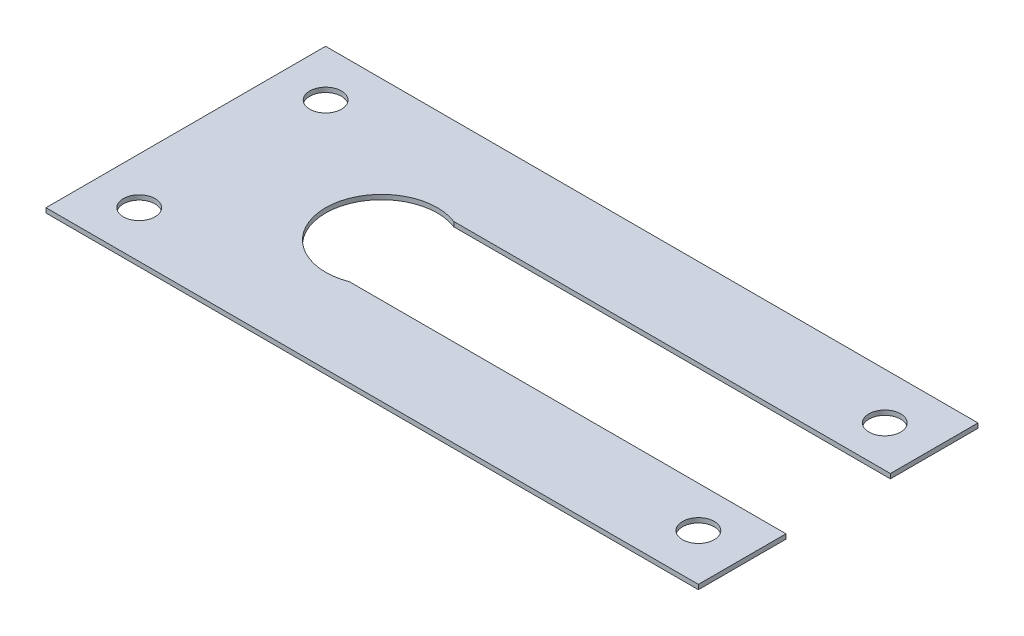
ISO-10303-21;
HEADER;
FILE_DESCRIPTION(('STEP AP214'),'2;1');
FILE_NAME('part.step','',(''),(''),'','','');
FILE_SCHEMA(('AUTOMOTIVE_DESIGN { 1 0 10303 214 1 1 1 1 }'));
ENDSEC;
DATA;
#1=APPLICATION_CONTEXT('core data for automotive mechanical design processes');
#2=APPLICATION_PROTOCOL_DEFINITION('international standard','automotive_design',2000,#1);
#3=PRODUCT_CONTEXT('',#1,'mechanical');
#4=PRODUCT('Part','Part','',(#3));
#5=PRODUCT_RELATED_PRODUCT_CATEGORY('part','',(#4));
#6=PRODUCT_DEFINITION_FORMATION('','',#4);
#7=PRODUCT_DEFINITION_CONTEXT('part definition',#1,'design');
#8=PRODUCT_DEFINITION('design','',#6,#7);
#9=PRODUCT_DEFINITION_SHAPE('','',#8);
#10=(LENGTH_UNIT() NAMED_UNIT(*) SI_UNIT(.MILLI.,.METRE.));
#11=(NAMED_UNIT(*) PLANE_ANGLE_UNIT() SI_UNIT($,.RADIAN.));
#12=(NAMED_UNIT(*) SI_UNIT($,.STERADIAN.) SOLID_ANGLE_UNIT());
#13=UNCERTAINTY_MEASURE_WITH_UNIT(LENGTH_MEASURE(1.E-05),#10,'distance_accuracy_value','');
#14=(GEOMETRIC_REPRESENTATION_CONTEXT(3) GLOBAL_UNCERTAINTY_ASSIGNED_CONTEXT((#13)) GLOBAL_UNIT_ASSIGNED_CONTEXT((#10,
#11,#12)) REPRESENTATION_CONTEXT('',''));
#15=CARTESIAN_POINT('',(0.,0.,0.));
#16=DIRECTION('',(0.,0.,1.));
#17=DIRECTION('',(1.,0.,0.));
#18=AXIS2_PLACEMENT_3D('',#15,#16,#17);
#19=CARTESIAN_POINT('',(35.,-0.5,-5.6));
#20=DIRECTION('',(1.,0.,0.));
#21=DIRECTION('',(0.,0.,-1.));
#22=AXIS2_PLACEMENT_3D('',#19,#20,#21);
#23=PLANE('',#22);
#24=DIRECTION('',(0.,0.,-1.));
#25=VECTOR('',#24,1.);
#26=CARTESIAN_POINT('',(35.,0.,-5.6));
#27=LINE('',#26,#25);
#28=CARTESIAN_POINT('',(35.,0.,-5.6));
#29=VERTEX_POINT('',#28);
#30=CARTESIAN_POINT('',(35.,0.,-15.));
#31=VERTEX_POINT('',#30);
#32=EDGE_CURVE('E147',#29,#31,#27,.T.);
#33=ORIENTED_EDGE('',*,*,#32,.F.);
#34=DIRECTION('',(0.,1.,0.));
#35=VECTOR('',#34,1.);
#36=CARTESIAN_POINT('',(35.,-0.5,-5.6));
#37=LINE('',#36,#35);
#38=CARTESIAN_POINT('',(35.,-0.5,-5.6));
#39=VERTEX_POINT('',#38);
#40=EDGE_CURVE('E11',#39,#29,#37,.T.);
#41=ORIENTED_EDGE('',*,*,#40,.F.);
#42=DIRECTION('',(0.,0.,-1.));
#43=VECTOR('',#42,1.);
#44=CARTESIAN_POINT('',(35.,-0.5,-5.6));
#45=LINE('',#44,#43);
#46=CARTESIAN_POINT('',(35.,-0.5,-15.));
#47=VERTEX_POINT('',#46);
#48=EDGE_CURVE('E176',#39,#47,#45,.T.);
#49=ORIENTED_EDGE('',*,*,#48,.T.);
#50=DIRECTION('',(0.,1.,0.));
#51=VECTOR('',#50,1.);
#52=CARTESIAN_POINT('',(35.,-0.5,-15.));
#53=LINE('',#52,#51);
#54=EDGE_CURVE('E46',#47,#31,#53,.T.);
#55=ORIENTED_EDGE('',*,*,#54,.T.);
#56=EDGE_LOOP('',(#33,#41,#49,#55));
#57=FACE_BOUND('',#56,.T.);
#58=ADVANCED_FACE('F43',(#57),#23,.T.);
#59=CARTESIAN_POINT('',(-11.8459340771462,-0.5,-5.6));
#60=DIRECTION('',(0.,0.,1.));
#61=DIRECTION('',(1.,0.,0.));
#62=AXIS2_PLACEMENT_3D('',#59,#60,#61);
#63=PLANE('',#62);
#64=DIRECTION('',(1.,0.,0.));
#65=VECTOR('',#64,1.);
#66=CARTESIAN_POINT('',(-11.8459340771462,0.,-5.6));
#67=LINE('',#66,#65);
#68=CARTESIAN_POINT('',(-11.8459340771462,0.,-5.6));
#69=VERTEX_POINT('',#68);
#70=EDGE_CURVE('E173',#69,#29,#67,.T.);
#71=ORIENTED_EDGE('',*,*,#70,.F.);
#72=DIRECTION('',(0.,1.,0.));
#73=VECTOR('',#72,1.);
#74=CARTESIAN_POINT('',(-11.8459340771462,-0.5,-5.6));
#75=LINE('',#74,#73);
#76=CARTESIAN_POINT('',(-11.8459340771462,-0.5,-5.6));
#77=VERTEX_POINT('',#76);
#78=EDGE_CURVE('E53',#77,#69,#75,.T.);
#79=ORIENTED_EDGE('',*,*,#78,.F.);
#80=DIRECTION('',(1.,0.,0.));
#81=VECTOR('',#80,1.);
#82=CARTESIAN_POINT('',(-11.8459340771462,-0.5,-5.6));
#83=LINE('',#82,#81);
#84=EDGE_CURVE('E132',#77,#39,#83,.T.);
#85=ORIENTED_EDGE('',*,*,#84,.T.);
#86=ORIENTED_EDGE('',*,*,#40,.T.);
#87=EDGE_LOOP('',(#71,#79,#85,#86));
#88=FACE_BOUND('',#87,.T.);
#89=ADVANCED_FACE('F196',(#88),#63,.T.);
#90=CARTESIAN_POINT('',(-14.,-0.5,0.));
#91=DIRECTION('',(0.,1.,0.));
#92=DIRECTION('',(0.,0.,1.));
#93=AXIS2_PLACEMENT_3D('',#90,#91,#92);
#94=CYLINDRICAL_SURFACE('',#93,6.);
#95=CARTESIAN_POINT('',(-14.,0.,0.));
#96=DIRECTION('',(0.,-1.,0.));
#97=DIRECTION('',(0.,0.,1.));
#98=AXIS2_PLACEMENT_3D('',#95,#96,#97);
#99=CIRCLE('',#98,6.);
#100=CARTESIAN_POINT('',(-11.8459340771462,0.,5.6));
#101=VERTEX_POINT('',#100);
#102=EDGE_CURVE('E118',#101,#69,#99,.T.);
#103=ORIENTED_EDGE('',*,*,#102,.F.);
#104=DIRECTION('',(0.,1.,0.));
#105=VECTOR('',#104,1.);
#106=CARTESIAN_POINT('',(-11.8459340771462,-0.5,5.6));
#107=LINE('',#106,#105);
#108=CARTESIAN_POINT('',(-11.8459340771462,-0.5,5.6));
#109=VERTEX_POINT('',#108);
#110=EDGE_CURVE('E113',#109,#101,#107,.T.);
#111=ORIENTED_EDGE('',*,*,#110,.F.);
#112=CARTESIAN_POINT('',(-14.,-0.5,0.));
#113=DIRECTION('',(0.,-1.,0.));
#114=DIRECTION('',(0.,0.,1.));
#115=AXIS2_PLACEMENT_3D('',#112,#113,#114);
#116=CIRCLE('',#115,6.);
#117=EDGE_CURVE('E116',#109,#77,#116,.T.);
#118=ORIENTED_EDGE('',*,*,#117,.T.);
#119=ORIENTED_EDGE('',*,*,#78,.T.);
#120=EDGE_LOOP('',(#103,#111,#118,#119));
#121=FACE_BOUND('',#120,.T.);
#122=ADVANCED_FACE('F115',(#121),#94,.F.);
#123=CARTESIAN_POINT('',(-11.8459340771462,-0.5,5.6));
#124=DIRECTION('',(0.,0.,-1.));
#125=DIRECTION('',(-1.,0.,0.));
#126=AXIS2_PLACEMENT_3D('',#123,#124,#125);
#127=PLANE('',#126);
#128=DIRECTION('',(-1.,0.,0.));
#129=VECTOR('',#128,1.);
#130=CARTESIAN_POINT('',(-11.8459340771462,0.,5.6));
#131=LINE('',#130,#129);
#132=CARTESIAN_POINT('',(35.,0.,5.6));
#133=VERTEX_POINT('',#132);
#134=EDGE_CURVE('E168',#133,#101,#131,.T.);
#135=ORIENTED_EDGE('',*,*,#134,.F.);
#136=DIRECTION('',(0.,1.,0.));
#137=VECTOR('',#136,1.);
#138=CARTESIAN_POINT('',(35.,-0.5,5.6));
#139=LINE('',#138,#137);
#140=CARTESIAN_POINT('',(35.,-0.5,5.6));
#141=VERTEX_POINT('',#140);
#142=EDGE_CURVE('E124',#141,#133,#139,.T.);
#143=ORIENTED_EDGE('',*,*,#142,.F.);
#144=DIRECTION('',(-1.,0.,0.));
#145=VECTOR('',#144,1.);
#146=CARTESIAN_POINT('',(-11.8459340771462,-0.5,5.6));
#147=LINE('',#146,#145);
#148=EDGE_CURVE('E130',#141,#109,#147,.T.);
#149=ORIENTED_EDGE('',*,*,#148,.T.);
#150=ORIENTED_EDGE('',*,*,#110,.T.);
#151=EDGE_LOOP('',(#135,#143,#149,#150));
#152=FACE_BOUND('',#151,.T.);
#153=ADVANCED_FACE('F135',(#152),#127,.T.);
#154=CARTESIAN_POINT('',(35.,-0.5,15.));
#155=DIRECTION('',(1.,0.,0.));
#156=DIRECTION('',(0.,0.,-1.));
#157=AXIS2_PLACEMENT_3D('',#154,#155,#156);
#158=PLANE('',#157);
#159=DIRECTION('',(0.,0.,-1.));
#160=VECTOR('',#159,1.);
#161=CARTESIAN_POINT('',(35.,0.,15.));
#162=LINE('',#161,#160);
#163=CARTESIAN_POINT('',(35.,0.,15.));
#164=VERTEX_POINT('',#163);
#165=EDGE_CURVE('E164',#164,#133,#162,.T.);
#166=ORIENTED_EDGE('',*,*,#165,.F.);
#167=DIRECTION('',(0.,1.,0.));
#168=VECTOR('',#167,1.);
#169=CARTESIAN_POINT('',(35.,-0.5,15.));
#170=LINE('',#169,#168);
#171=CARTESIAN_POINT('',(35.,-0.5,15.));
#172=VERTEX_POINT('',#171);
#173=EDGE_CURVE('E182',#172,#164,#170,.T.);
#174=ORIENTED_EDGE('',*,*,#173,.F.);
#175=DIRECTION('',(0.,0.,-1.));
#176=VECTOR('',#175,1.);
#177=CARTESIAN_POINT('',(35.,-0.5,15.));
#178=LINE('',#177,#176);
#179=EDGE_CURVE('E137',#172,#141,#178,.T.);
#180=ORIENTED_EDGE('',*,*,#179,.T.);
#181=ORIENTED_EDGE('',*,*,#142,.T.);
#182=EDGE_LOOP('',(#166,#174,#180,#181));
#183=FACE_BOUND('',#182,.T.);
#184=ADVANCED_FACE('F209',(#183),#158,.T.);
#185=CARTESIAN_POINT('',(-35.,-0.5,15.));
#186=DIRECTION('',(0.,0.,1.));
#187=DIRECTION('',(1.,0.,0.));
#188=AXIS2_PLACEMENT_3D('',#185,#186,#187);
#189=PLANE('',#188);
#190=DIRECTION('',(1.,0.,0.));
#191=VECTOR('',#190,1.);
#192=CARTESIAN_POINT('',(-35.,0.,15.));
#193=LINE('',#192,#191);
#194=CARTESIAN_POINT('',(-35.,0.,15.));
#195=VERTEX_POINT('',#194);
#196=EDGE_CURVE('E160',#195,#164,#193,.T.);
#197=ORIENTED_EDGE('',*,*,#196,.F.);
#198=DIRECTION('',(0.,1.,0.));
#199=VECTOR('',#198,1.);
#200=CARTESIAN_POINT('',(-35.,-0.5,15.));
#201=LINE('',#200,#199);
#202=CARTESIAN_POINT('',(-35.,-0.5,15.));
#203=VERTEX_POINT('',#202);
#204=EDGE_CURVE('E185',#203,#195,#201,.T.);
#205=ORIENTED_EDGE('',*,*,#204,.F.);
#206=DIRECTION('',(1.,0.,0.));
#207=VECTOR('',#206,1.);
#208=CARTESIAN_POINT('',(-35.,-0.5,15.));
#209=LINE('',#208,#207);
#210=EDGE_CURVE('E141',#203,#172,#209,.T.);
#211=ORIENTED_EDGE('',*,*,#210,.T.);
#212=ORIENTED_EDGE('',*,*,#173,.T.);
#213=EDGE_LOOP('',(#197,#205,#211,#212));
#214=FACE_BOUND('',#213,.T.);
#215=ADVANCED_FACE('F212',(#214),#189,.T.);
#216=CARTESIAN_POINT('',(-35.,-0.5,15.));
#217=DIRECTION('',(-1.,0.,0.));
#218=DIRECTION('',(0.,0.,1.));
#219=AXIS2_PLACEMENT_3D('',#216,#217,#218);
#220=PLANE('',#219);
#221=DIRECTION('',(0.,0.,1.));
#222=VECTOR('',#221,1.);
#223=CARTESIAN_POINT('',(-35.,0.,15.));
#224=LINE('',#223,#222);
#225=CARTESIAN_POINT('',(-35.,0.,-15.));
#226=VERTEX_POINT('',#225);
#227=EDGE_CURVE('E156',#226,#195,#224,.T.);
#228=ORIENTED_EDGE('',*,*,#227,.F.);
#229=DIRECTION('',(0.,1.,0.));
#230=VECTOR('',#229,1.);
#231=CARTESIAN_POINT('',(-35.,-0.5,-15.));
#232=LINE('',#231,#230);
#233=CARTESIAN_POINT('',(-35.,-0.5,-15.));
#234=VERTEX_POINT('',#233);
#235=EDGE_CURVE('E187',#234,#226,#232,.T.);
#236=ORIENTED_EDGE('',*,*,#235,.F.);
#237=DIRECTION('',(0.,0.,1.));
#238=VECTOR('',#237,1.);
#239=CARTESIAN_POINT('',(-35.,-0.5,15.));
#240=LINE('',#239,#238);
#241=EDGE_CURVE('E289',#234,#203,#240,.T.);
#242=ORIENTED_EDGE('',*,*,#241,.T.);
#243=ORIENTED_EDGE('',*,*,#204,.T.);
#244=EDGE_LOOP('',(#228,#236,#242,#243));
#245=FACE_BOUND('',#244,.T.);
#246=ADVANCED_FACE('F216',(#245),#220,.T.);
#247=CARTESIAN_POINT('',(-35.,-0.5,-15.));
#248=DIRECTION('',(0.,0.,-1.));
#249=DIRECTION('',(-1.,0.,0.));
#250=AXIS2_PLACEMENT_3D('',#247,#248,#249);
#251=PLANE('',#250);
#252=DIRECTION('',(-1.,0.,0.));
#253=VECTOR('',#252,1.);
#254=CARTESIAN_POINT('',(-35.,0.,-15.));
#255=LINE('',#254,#253);
#256=EDGE_CURVE('E151',#31,#226,#255,.T.);
#257=ORIENTED_EDGE('',*,*,#256,.F.);
#258=ORIENTED_EDGE('',*,*,#54,.F.);
#259=DIRECTION('',(-1.,0.,0.));
#260=VECTOR('',#259,1.);
#261=CARTESIAN_POINT('',(-35.,-0.5,-15.));
#262=LINE('',#261,#260);
#263=EDGE_CURVE('E286',#47,#234,#262,.T.);
#264=ORIENTED_EDGE('',*,*,#263,.T.);
#265=ORIENTED_EDGE('',*,*,#235,.T.);
#266=EDGE_LOOP('',(#257,#258,#264,#265));
#267=FACE_BOUND('',#266,.T.);
#268=ADVANCED_FACE('F193',(#267),#251,.T.);
#269=CARTESIAN_POINT('',(-14.,-0.5,0.));
#270=DIRECTION('',(0.,1.,0.));
#271=DIRECTION('',(0.,0.,1.));
#272=AXIS2_PLACEMENT_3D('',#269,#270,#271);
#273=PLANE('',#272);
#274=CARTESIAN_POINT('',(-30.,-0.5,-10.));
#275=DIRECTION('',(0.,1.,0.));
#276=DIRECTION('',(0.,0.,-1.));
#277=AXIS2_PLACEMENT_3D('',#274,#275,#276);
#278=CIRCLE('',#277,1.7);
#279=CARTESIAN_POINT('',(-30.,-0.5,-11.7));
#280=VERTEX_POINT('',#279);
#281=EDGE_CURVE('E251',#280,#280,#278,.T.);
#282=ORIENTED_EDGE('',*,*,#281,.T.);
#283=EDGE_LOOP('',(#282));
#284=FACE_BOUND('',#283,.T.);
#285=CARTESIAN_POINT('',(-30.,-0.5,10.));
#286=DIRECTION('',(0.,1.,0.));
#287=DIRECTION('',(0.,0.,1.));
#288=AXIS2_PLACEMENT_3D('',#285,#286,#287);
#289=CIRCLE('',#288,1.7);
#290=CARTESIAN_POINT('',(-30.,-0.5,11.7));
#291=VERTEX_POINT('',#290);
#292=EDGE_CURVE('E262',#291,#291,#289,.T.);
#293=ORIENTED_EDGE('',*,*,#292,.T.);
#294=EDGE_LOOP('',(#293));
#295=FACE_BOUND('',#294,.T.);
#296=CARTESIAN_POINT('',(30.,-0.5,10.));
#297=DIRECTION('',(0.,1.,0.));
#298=DIRECTION('',(0.,0.,-1.));
#299=AXIS2_PLACEMENT_3D('',#296,#297,#298);
#300=CIRCLE('',#299,1.7);
#301=CARTESIAN_POINT('',(30.,-0.5,8.3));
#302=VERTEX_POINT('',#301);
#303=EDGE_CURVE('E270',#302,#302,#300,.T.);
#304=ORIENTED_EDGE('',*,*,#303,.T.);
#305=EDGE_LOOP('',(#304));
#306=FACE_BOUND('',#305,.T.);
#307=CARTESIAN_POINT('',(30.,-0.5,-10.));
#308=DIRECTION('',(0.,1.,0.));
#309=DIRECTION('',(0.,0.,1.));
#310=AXIS2_PLACEMENT_3D('',#307,#308,#309);
#311=CIRCLE('',#310,1.7);
#312=CARTESIAN_POINT('',(30.,-0.5,-8.3));
#313=VERTEX_POINT('',#312);
#314=EDGE_CURVE('E152',#313,#313,#311,.T.);
#315=ORIENTED_EDGE('',*,*,#314,.T.);
#316=EDGE_LOOP('',(#315));
#317=FACE_BOUND('',#316,.T.);
#318=ORIENTED_EDGE('',*,*,#48,.F.);
#319=ORIENTED_EDGE('',*,*,#84,.F.);
#320=ORIENTED_EDGE('',*,*,#117,.F.);
#321=ORIENTED_EDGE('',*,*,#148,.F.);
#322=ORIENTED_EDGE('',*,*,#179,.F.);
#323=ORIENTED_EDGE('',*,*,#210,.F.);
#324=ORIENTED_EDGE('',*,*,#241,.F.);
#325=ORIENTED_EDGE('',*,*,#263,.F.);
#326=EDGE_LOOP('',(#318,#319,#320,#321,#322,#323,#324,#325));
#327=FACE_BOUND('',#326,.T.);
#328=ADVANCED_FACE('F128',(#284,#295,#306,#317,#327),#273,.F.);
#329=CARTESIAN_POINT('',(-14.,0.,0.));
#330=DIRECTION('',(0.,1.,0.));
#331=DIRECTION('',(0.,0.,1.));
#332=AXIS2_PLACEMENT_3D('',#329,#330,#331);
#333=PLANE('',#332);
#334=CARTESIAN_POINT('',(-30.,0.,-10.));
#335=DIRECTION('',(0.,1.,0.));
#336=DIRECTION('',(0.,0.,-1.));
#337=AXIS2_PLACEMENT_3D('',#334,#335,#336);
#338=CIRCLE('',#337,1.7);
#339=CARTESIAN_POINT('',(-30.,0.,-11.7));
#340=VERTEX_POINT('',#339);
#341=EDGE_CURVE('E254',#340,#340,#338,.T.);
#342=ORIENTED_EDGE('',*,*,#341,.F.);
#343=EDGE_LOOP('',(#342));
#344=FACE_BOUND('',#343,.T.);
#345=CARTESIAN_POINT('',(-30.,0.,10.));
#346=DIRECTION('',(0.,1.,0.));
#347=DIRECTION('',(0.,0.,1.));
#348=AXIS2_PLACEMENT_3D('',#345,#346,#347);
#349=CIRCLE('',#348,1.7);
#350=CARTESIAN_POINT('',(-30.,0.,11.7));
#351=VERTEX_POINT('',#350);
#352=EDGE_CURVE('E259',#351,#351,#349,.T.);
#353=ORIENTED_EDGE('',*,*,#352,.F.);
#354=EDGE_LOOP('',(#353));
#355=FACE_BOUND('',#354,.T.);
#356=CARTESIAN_POINT('',(30.,0.,10.));
#357=DIRECTION('',(0.,1.,0.));
#358=DIRECTION('',(0.,0.,-1.));
#359=AXIS2_PLACEMENT_3D('',#356,#357,#358);
#360=CIRCLE('',#359,1.7);
#361=CARTESIAN_POINT('',(30.,0.,8.3));
#362=VERTEX_POINT('',#361);
#363=EDGE_CURVE('E266',#362,#362,#360,.T.);
#364=ORIENTED_EDGE('',*,*,#363,.F.);
#365=EDGE_LOOP('',(#364));
#366=FACE_BOUND('',#365,.T.);
#367=CARTESIAN_POINT('',(30.,0.,-10.));
#368=DIRECTION('',(0.,1.,0.));
#369=DIRECTION('',(0.,0.,1.));
#370=AXIS2_PLACEMENT_3D('',#367,#368,#369);
#371=CIRCLE('',#370,1.7);
#372=CARTESIAN_POINT('',(30.,0.,-8.3));
#373=VERTEX_POINT('',#372);
#374=EDGE_CURVE('E274',#373,#373,#371,.T.);
#375=ORIENTED_EDGE('',*,*,#374,.F.);
#376=EDGE_LOOP('',(#375));
#377=FACE_BOUND('',#376,.T.);
#378=ORIENTED_EDGE('',*,*,#32,.T.);
#379=ORIENTED_EDGE('',*,*,#256,.T.);
#380=ORIENTED_EDGE('',*,*,#227,.T.);
#381=ORIENTED_EDGE('',*,*,#196,.T.);
#382=ORIENTED_EDGE('',*,*,#165,.T.);
#383=ORIENTED_EDGE('',*,*,#134,.T.);
#384=ORIENTED_EDGE('',*,*,#102,.T.);
#385=ORIENTED_EDGE('',*,*,#70,.T.);
#386=EDGE_LOOP('',(#378,#379,#380,#381,#382,#383,#384,#385));
#387=FACE_BOUND('',#386,.T.);
#388=ADVANCED_FACE('F195',(#344,#355,#366,#377,#387),#333,.T.);
#389=CARTESIAN_POINT('',(30.,-0.5,-10.));
#390=DIRECTION('',(0.,1.,0.));
#391=DIRECTION('',(0.,0.,1.));
#392=AXIS2_PLACEMENT_3D('',#389,#390,#391);
#393=CYLINDRICAL_SURFACE('',#392,1.7);
#394=ORIENTED_EDGE('',*,*,#314,.F.);
#395=EDGE_LOOP('',(#394));
#396=FACE_BOUND('',#395,.T.);
#397=ORIENTED_EDGE('',*,*,#374,.T.);
#398=EDGE_LOOP('',(#397));
#399=FACE_BOUND('',#398,.T.);
#400=ADVANCED_FACE('F228',(#396,#399),#393,.F.);
#401=CARTESIAN_POINT('',(30.,-0.5,10.));
#402=DIRECTION('',(0.,1.,0.));
#403=DIRECTION('',(0.,0.,1.));
#404=AXIS2_PLACEMENT_3D('',#401,#402,#403);
#405=CYLINDRICAL_SURFACE('',#404,1.7);
#406=ORIENTED_EDGE('',*,*,#303,.F.);
#407=EDGE_LOOP('',(#406));
#408=FACE_BOUND('',#407,.T.);
#409=ORIENTED_EDGE('',*,*,#363,.T.);
#410=EDGE_LOOP('',(#409));
#411=FACE_BOUND('',#410,.T.);
#412=ADVANCED_FACE('F235',(#408,#411),#405,.F.);
#413=CARTESIAN_POINT('',(-30.,-0.5,10.));
#414=DIRECTION('',(0.,1.,0.));
#415=DIRECTION('',(0.,0.,1.));
#416=AXIS2_PLACEMENT_3D('',#413,#414,#415);
#417=CYLINDRICAL_SURFACE('',#416,1.7);
#418=ORIENTED_EDGE('',*,*,#292,.F.);
#419=EDGE_LOOP('',(#418));
#420=FACE_BOUND('',#419,.T.);
#421=ORIENTED_EDGE('',*,*,#352,.T.);
#422=EDGE_LOOP('',(#421));
#423=FACE_BOUND('',#422,.T.);
#424=ADVANCED_FACE('F239',(#420,#423),#417,.F.);
#425=CARTESIAN_POINT('',(-30.,-0.5,-10.));
#426=DIRECTION('',(0.,1.,0.));
#427=DIRECTION('',(0.,0.,1.));
#428=AXIS2_PLACEMENT_3D('',#425,#426,#427);
#429=CYLINDRICAL_SURFACE('',#428,1.7);
#430=ORIENTED_EDGE('',*,*,#281,.F.);
#431=EDGE_LOOP('',(#430));
#432=FACE_BOUND('',#431,.T.);
#433=ORIENTED_EDGE('',*,*,#341,.T.);
#434=EDGE_LOOP('',(#433));
#435=FACE_BOUND('',#434,.T.);
#436=ADVANCED_FACE('F243',(#432,#435),#429,.F.);
#437=CLOSED_SHELL('',(#58,#89,#122,#153,#184,#215,#246,#268,#328,#388,#400,#412,#424,#436));
#438=MANIFOLD_SOLID_BREP('B2',#437);
#439=ADVANCED_BREP_SHAPE_REPRESENTATION('',(#18,#438),#14);
#440=SHAPE_DEFINITION_REPRESENTATION(#9,#439);
ENDSEC;
END-ISO-10303-21;
